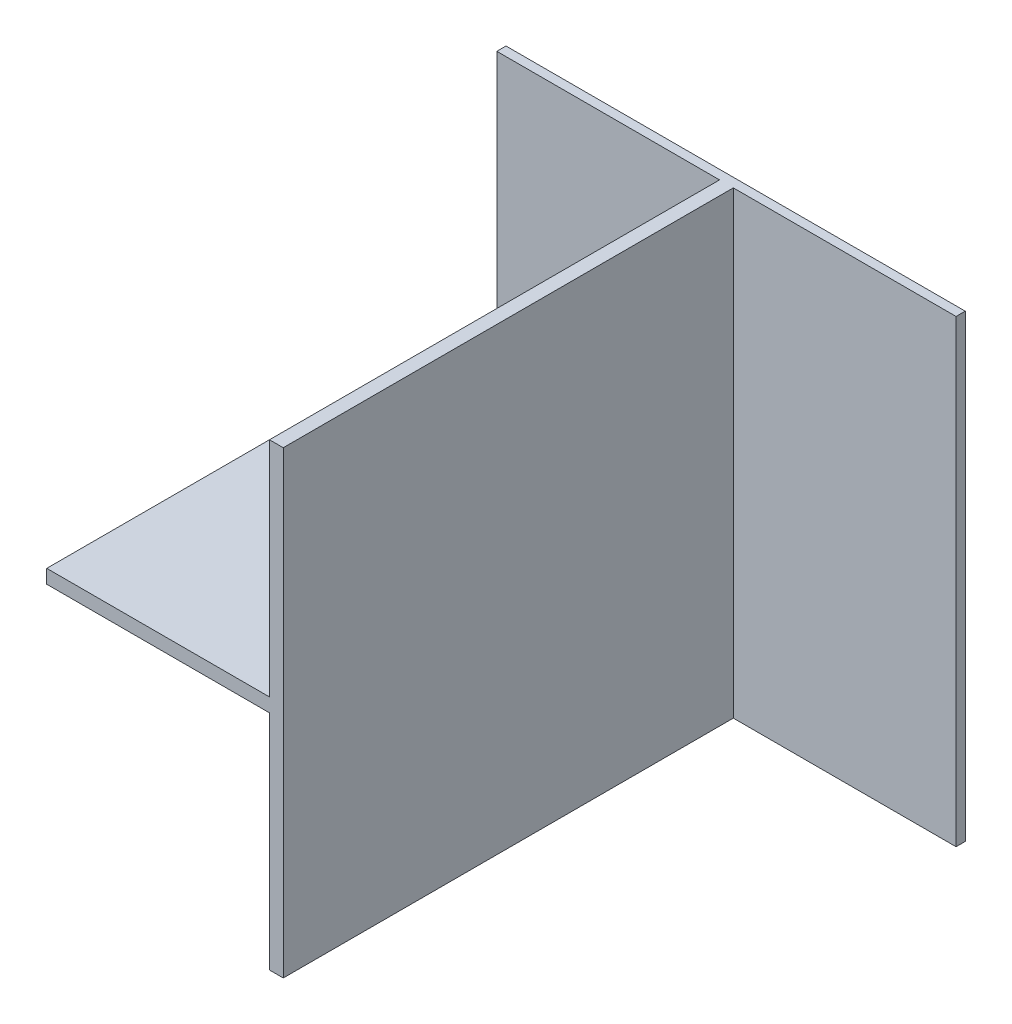
ISO-10303-21;
HEADER;
FILE_DESCRIPTION(('STEP AP214'),'2;1');
FILE_NAME('part.step','',(''),(''),'','','');
FILE_SCHEMA(('AUTOMOTIVE_DESIGN { 1 0 10303 214 1 1 1 1 }'));
ENDSEC;
DATA;
#1=APPLICATION_CONTEXT('core data for automotive mechanical design processes');
#2=APPLICATION_PROTOCOL_DEFINITION('international standard','automotive_design',2000,#1);
#3=PRODUCT_CONTEXT('',#1,'mechanical');
#4=PRODUCT('Part','Part','',(#3));
#5=PRODUCT_RELATED_PRODUCT_CATEGORY('part','',(#4));
#6=PRODUCT_DEFINITION_FORMATION('','',#4);
#7=PRODUCT_DEFINITION_CONTEXT('part definition',#1,'design');
#8=PRODUCT_DEFINITION('design','',#6,#7);
#9=PRODUCT_DEFINITION_SHAPE('','',#8);
#10=(LENGTH_UNIT() NAMED_UNIT(*) SI_UNIT(.MILLI.,.METRE.));
#11=(NAMED_UNIT(*) PLANE_ANGLE_UNIT() SI_UNIT($,.RADIAN.));
#12=(NAMED_UNIT(*) SI_UNIT($,.STERADIAN.) SOLID_ANGLE_UNIT());
#13=UNCERTAINTY_MEASURE_WITH_UNIT(LENGTH_MEASURE(1.E-05),#10,'distance_accuracy_value','');
#14=(GEOMETRIC_REPRESENTATION_CONTEXT(3) GLOBAL_UNCERTAINTY_ASSIGNED_CONTEXT((#13)) GLOBAL_UNIT_ASSIGNED_CONTEXT((#10,
#11,#12)) REPRESENTATION_CONTEXT('',''));
#15=CARTESIAN_POINT('',(0.,0.,0.));
#16=DIRECTION('',(0.,0.,1.));
#17=DIRECTION('',(1.,0.,0.));
#18=AXIS2_PLACEMENT_3D('',#15,#16,#17);
#19=CARTESIAN_POINT('',(0.,0.,4.));
#20=DIRECTION('',(0.,0.,1.));
#21=DIRECTION('',(1.,0.,0.));
#22=AXIS2_PLACEMENT_3D('',#19,#20,#21);
#23=PLANE('',#22);
#24=DIRECTION('',(-1.,0.,0.));
#25=VECTOR('',#24,1.);
#26=CARTESIAN_POINT('',(0.,2.99999999999999,4.));
#27=LINE('',#26,#25);
#28=CARTESIAN_POINT('',(-3.,2.99999999999999,4.));
#29=VERTEX_POINT('',#28);
#30=CARTESIAN_POINT('',(-100.,2.99999999999999,4.));
#31=VERTEX_POINT('',#30);
#32=EDGE_CURVE('E166',#29,#31,#27,.T.);
#33=ORIENTED_EDGE('',*,*,#32,.F.);
#34=DIRECTION('',(0.,1.,0.));
#35=VECTOR('',#34,1.);
#36=CARTESIAN_POINT('',(-3.,0.,4.));
#37=LINE('',#36,#35);
#38=CARTESIAN_POINT('',(-3.,100.,4.));
#39=VERTEX_POINT('',#38);
#40=EDGE_CURVE('E174',#29,#39,#37,.T.);
#41=ORIENTED_EDGE('',*,*,#40,.T.);
#42=DIRECTION('',(-1.,0.,0.));
#43=VECTOR('',#42,1.);
#44=CARTESIAN_POINT('',(0.,100.,4.));
#45=LINE('',#44,#43);
#46=CARTESIAN_POINT('',(-100.,100.,4.));
#47=VERTEX_POINT('',#46);
#48=EDGE_CURVE('E191',#39,#47,#45,.T.);
#49=ORIENTED_EDGE('',*,*,#48,.T.);
#50=DIRECTION('',(0.,-1.,0.));
#51=VECTOR('',#50,1.);
#52=CARTESIAN_POINT('',(-100.,0.,4.));
#53=LINE('',#52,#51);
#54=EDGE_CURVE('E196',#47,#31,#53,.T.);
#55=ORIENTED_EDGE('',*,*,#54,.T.);
#56=EDGE_LOOP('',(#33,#41,#49,#55));
#57=FACE_BOUND('',#56,.T.);
#58=ADVANCED_FACE('F39',(#57),#23,.T.);
#59=DIRECTION('',(-1.,0.,0.));
#60=VECTOR('',#59,1.);
#61=CARTESIAN_POINT('',(0.,-100.,4.));
#62=LINE('',#61,#60);
#63=CARTESIAN_POINT('',(-3.,-100.,4.));
#64=VERTEX_POINT('',#63);
#65=CARTESIAN_POINT('',(-100.,-100.,4.));
#66=VERTEX_POINT('',#65);
#67=EDGE_CURVE('E187',#64,#66,#62,.T.);
#68=ORIENTED_EDGE('',*,*,#67,.F.);
#69=DIRECTION('',(0.,1.,0.));
#70=VECTOR('',#69,1.);
#71=CARTESIAN_POINT('',(-3.,0.,4.));
#72=LINE('',#71,#70);
#73=CARTESIAN_POINT('',(-3.,-3.00000000000001,4.));
#74=VERTEX_POINT('',#73);
#75=EDGE_CURVE('E160',#64,#74,#72,.T.);
#76=ORIENTED_EDGE('',*,*,#75,.T.);
#77=DIRECTION('',(-1.,0.,0.));
#78=VECTOR('',#77,1.);
#79=CARTESIAN_POINT('',(0.,-3.00000000000002,4.));
#80=LINE('',#79,#78);
#81=CARTESIAN_POINT('',(-100.,-3.00000000000001,4.));
#82=VERTEX_POINT('',#81);
#83=EDGE_CURVE('E162',#74,#82,#80,.T.);
#84=ORIENTED_EDGE('',*,*,#83,.T.);
#85=EDGE_CURVE('E63',#82,#66,#53,.T.);
#86=ORIENTED_EDGE('',*,*,#85,.T.);
#87=EDGE_LOOP('',(#68,#76,#84,#86));
#88=FACE_BOUND('',#87,.T.);
#89=ADVANCED_FACE('F289',(#88),#23,.T.);
#90=CARTESIAN_POINT('',(0.,-100.,4.));
#91=DIRECTION('',(0.,-1.,0.));
#92=DIRECTION('',(0.,0.,-1.));
#93=AXIS2_PLACEMENT_3D('',#90,#91,#92);
#94=PLANE('',#93);
#95=CARTESIAN_POINT('',(100.,-100.,4.));
#96=VERTEX_POINT('',#95);
#97=CARTESIAN_POINT('',(3.,-100.,4.));
#98=VERTEX_POINT('',#97);
#99=EDGE_CURVE('E183',#96,#98,#62,.T.);
#100=ORIENTED_EDGE('',*,*,#99,.T.);
#101=DIRECTION('',(0.,0.,-1.));
#102=VECTOR('',#101,1.);
#103=CARTESIAN_POINT('',(3.,-100.,200.));
#104=LINE('',#103,#102);
#105=CARTESIAN_POINT('',(3.,-100.,200.));
#106=VERTEX_POINT('',#105);
#107=EDGE_CURVE('E141',#106,#98,#104,.T.);
#108=ORIENTED_EDGE('',*,*,#107,.F.);
#109=DIRECTION('',(1.,0.,0.));
#110=VECTOR('',#109,1.);
#111=CARTESIAN_POINT('',(0.,-100.,200.));
#112=LINE('',#111,#110);
#113=CARTESIAN_POINT('',(-3.,-100.,200.));
#114=VERTEX_POINT('',#113);
#115=EDGE_CURVE('E137',#114,#106,#112,.T.);
#116=ORIENTED_EDGE('',*,*,#115,.F.);
#117=DIRECTION('',(0.,0.,-1.));
#118=VECTOR('',#117,1.);
#119=CARTESIAN_POINT('',(-3.,-100.,200.));
#120=LINE('',#119,#118);
#121=EDGE_CURVE('E140',#114,#64,#120,.T.);
#122=ORIENTED_EDGE('',*,*,#121,.T.);
#123=ORIENTED_EDGE('',*,*,#67,.T.);
#124=DIRECTION('',(0.,0.,-1.));
#125=VECTOR('',#124,1.);
#126=CARTESIAN_POINT('',(-100.,-100.,4.));
#127=LINE('',#126,#125);
#128=CARTESIAN_POINT('',(-100.,-100.,0.));
#129=VERTEX_POINT('',#128);
#130=EDGE_CURVE('E200',#66,#129,#127,.T.);
#131=ORIENTED_EDGE('',*,*,#130,.T.);
#132=DIRECTION('',(-1.,0.,0.));
#133=VECTOR('',#132,1.);
#134=CARTESIAN_POINT('',(0.,-100.,0.));
#135=LINE('',#134,#133);
#136=CARTESIAN_POINT('',(100.,-100.,0.));
#137=VERTEX_POINT('',#136);
#138=EDGE_CURVE('E85',#137,#129,#135,.T.);
#139=ORIENTED_EDGE('',*,*,#138,.F.);
#140=DIRECTION('',(0.,0.,-1.));
#141=VECTOR('',#140,1.);
#142=CARTESIAN_POINT('',(100.,-100.,4.));
#143=LINE('',#142,#141);
#144=EDGE_CURVE('E11',#96,#137,#143,.T.);
#145=ORIENTED_EDGE('',*,*,#144,.F.);
#146=EDGE_LOOP('',(#100,#108,#116,#122,#123,#131,#139,#145));
#147=FACE_BOUND('',#146,.T.);
#148=ADVANCED_FACE('F41',(#147),#94,.T.);
#149=CARTESIAN_POINT('',(100.,0.,4.));
#150=DIRECTION('',(1.,0.,0.));
#151=DIRECTION('',(0.,0.,-1.));
#152=AXIS2_PLACEMENT_3D('',#149,#150,#151);
#153=PLANE('',#152);
#154=DIRECTION('',(0.,-1.,0.));
#155=VECTOR('',#154,1.);
#156=CARTESIAN_POINT('',(100.,0.,0.));
#157=LINE('',#156,#155);
#158=CARTESIAN_POINT('',(100.,100.,0.));
#159=VERTEX_POINT('',#158);
#160=EDGE_CURVE('E203',#159,#137,#157,.T.);
#161=ORIENTED_EDGE('',*,*,#160,.F.);
#162=DIRECTION('',(0.,0.,-1.));
#163=VECTOR('',#162,1.);
#164=CARTESIAN_POINT('',(100.,100.,4.));
#165=LINE('',#164,#163);
#166=CARTESIAN_POINT('',(100.,100.,4.));
#167=VERTEX_POINT('',#166);
#168=EDGE_CURVE('E48',#167,#159,#165,.T.);
#169=ORIENTED_EDGE('',*,*,#168,.F.);
#170=DIRECTION('',(0.,-1.,0.));
#171=VECTOR('',#170,1.);
#172=CARTESIAN_POINT('',(100.,0.,4.));
#173=LINE('',#172,#171);
#174=EDGE_CURVE('E186',#167,#96,#173,.T.);
#175=ORIENTED_EDGE('',*,*,#174,.T.);
#176=ORIENTED_EDGE('',*,*,#144,.T.);
#177=EDGE_LOOP('',(#161,#169,#175,#176));
#178=FACE_BOUND('',#177,.T.);
#179=ADVANCED_FACE('F229',(#178),#153,.T.);
#180=CARTESIAN_POINT('',(0.,100.,4.));
#181=DIRECTION('',(0.,-1.,0.));
#182=DIRECTION('',(0.,0.,-1.));
#183=AXIS2_PLACEMENT_3D('',#180,#181,#182);
#184=PLANE('',#183);
#185=DIRECTION('',(-1.,0.,0.));
#186=VECTOR('',#185,1.);
#187=CARTESIAN_POINT('',(0.,100.,0.));
#188=LINE('',#187,#186);
#189=CARTESIAN_POINT('',(-100.,100.,0.));
#190=VERTEX_POINT('',#189);
#191=EDGE_CURVE('E206',#159,#190,#188,.T.);
#192=ORIENTED_EDGE('',*,*,#191,.T.);
#193=DIRECTION('',(0.,0.,-1.));
#194=VECTOR('',#193,1.);
#195=CARTESIAN_POINT('',(-100.,100.,4.));
#196=LINE('',#195,#194);
#197=EDGE_CURVE('E215',#47,#190,#196,.T.);
#198=ORIENTED_EDGE('',*,*,#197,.F.);
#199=ORIENTED_EDGE('',*,*,#48,.F.);
#200=DIRECTION('',(0.,0.,-1.));
#201=VECTOR('',#200,1.);
#202=CARTESIAN_POINT('',(-3.,100.,200.));
#203=LINE('',#202,#201);
#204=CARTESIAN_POINT('',(-3.,100.,200.));
#205=VERTEX_POINT('',#204);
#206=EDGE_CURVE('E238',#205,#39,#203,.T.);
#207=ORIENTED_EDGE('',*,*,#206,.F.);
#208=DIRECTION('',(-1.,0.,0.));
#209=VECTOR('',#208,1.);
#210=CARTESIAN_POINT('',(0.,100.,200.));
#211=LINE('',#210,#209);
#212=CARTESIAN_POINT('',(3.,100.,200.));
#213=VERTEX_POINT('',#212);
#214=EDGE_CURVE('E264',#213,#205,#211,.T.);
#215=ORIENTED_EDGE('',*,*,#214,.F.);
#216=DIRECTION('',(0.,0.,-1.));
#217=VECTOR('',#216,1.);
#218=CARTESIAN_POINT('',(3.,100.,200.));
#219=LINE('',#218,#217);
#220=CARTESIAN_POINT('',(3.,100.,4.));
#221=VERTEX_POINT('',#220);
#222=EDGE_CURVE('E168',#213,#221,#219,.T.);
#223=ORIENTED_EDGE('',*,*,#222,.T.);
#224=EDGE_CURVE('E192',#167,#221,#45,.T.);
#225=ORIENTED_EDGE('',*,*,#224,.F.);
#226=ORIENTED_EDGE('',*,*,#168,.T.);
#227=EDGE_LOOP('',(#192,#198,#199,#207,#215,#223,#225,#226));
#228=FACE_BOUND('',#227,.T.);
#229=ADVANCED_FACE('F222',(#228),#184,.F.);
#230=CARTESIAN_POINT('',(-100.,0.,4.));
#231=DIRECTION('',(1.,0.,0.));
#232=DIRECTION('',(0.,0.,-1.));
#233=AXIS2_PLACEMENT_3D('',#230,#231,#232);
#234=PLANE('',#233);
#235=DIRECTION('',(0.,-1.,0.));
#236=VECTOR('',#235,1.);
#237=CARTESIAN_POINT('',(-100.,0.,0.));
#238=LINE('',#237,#236);
#239=EDGE_CURVE('E209',#190,#129,#238,.T.);
#240=ORIENTED_EDGE('',*,*,#239,.T.);
#241=ORIENTED_EDGE('',*,*,#130,.F.);
#242=ORIENTED_EDGE('',*,*,#85,.F.);
#243=DIRECTION('',(0.,0.,-1.));
#244=VECTOR('',#243,1.);
#245=CARTESIAN_POINT('',(-100.,-3.00000000000001,200.));
#246=LINE('',#245,#244);
#247=CARTESIAN_POINT('',(-100.,-3.00000000000001,200.));
#248=VERTEX_POINT('',#247);
#249=EDGE_CURVE('E55',#248,#82,#246,.T.);
#250=ORIENTED_EDGE('',*,*,#249,.F.);
#251=DIRECTION('',(0.,1.,0.));
#252=VECTOR('',#251,1.);
#253=CARTESIAN_POINT('',(-100.,0.,200.));
#254=LINE('',#253,#252);
#255=CARTESIAN_POINT('',(-100.,2.99999999999999,200.));
#256=VERTEX_POINT('',#255);
#257=EDGE_CURVE('E280',#248,#256,#254,.T.);
#258=ORIENTED_EDGE('',*,*,#257,.T.);
#259=DIRECTION('',(0.,0.,-1.));
#260=VECTOR('',#259,1.);
#261=CARTESIAN_POINT('',(-100.,2.99999999999999,200.));
#262=LINE('',#261,#260);
#263=EDGE_CURVE('E256',#256,#31,#262,.T.);
#264=ORIENTED_EDGE('',*,*,#263,.T.);
#265=ORIENTED_EDGE('',*,*,#54,.F.);
#266=ORIENTED_EDGE('',*,*,#197,.T.);
#267=EDGE_LOOP('',(#240,#241,#242,#250,#258,#264,#265,#266));
#268=FACE_BOUND('',#267,.T.);
#269=ADVANCED_FACE('F232',(#268),#234,.F.);
#270=DIRECTION('',(0.,1.,0.));
#271=VECTOR('',#270,1.);
#272=CARTESIAN_POINT('',(3.,0.,4.));
#273=LINE('',#272,#271);
#274=EDGE_CURVE('E178',#98,#221,#273,.T.);
#275=ORIENTED_EDGE('',*,*,#274,.F.);
#276=ORIENTED_EDGE('',*,*,#99,.F.);
#277=ORIENTED_EDGE('',*,*,#174,.F.);
#278=ORIENTED_EDGE('',*,*,#224,.T.);
#279=EDGE_LOOP('',(#275,#276,#277,#278));
#280=FACE_BOUND('',#279,.T.);
#281=ADVANCED_FACE('F268',(#280),#23,.T.);
#282=CARTESIAN_POINT('',(0.,0.,0.));
#283=DIRECTION('',(0.,0.,1.));
#284=DIRECTION('',(1.,0.,0.));
#285=AXIS2_PLACEMENT_3D('',#282,#283,#284);
#286=PLANE('',#285);
#287=ORIENTED_EDGE('',*,*,#138,.T.);
#288=ORIENTED_EDGE('',*,*,#239,.F.);
#289=ORIENTED_EDGE('',*,*,#191,.F.);
#290=ORIENTED_EDGE('',*,*,#160,.T.);
#291=EDGE_LOOP('',(#287,#288,#289,#290));
#292=FACE_BOUND('',#291,.T.);
#293=ADVANCED_FACE('F228',(#292),#286,.F.);
#294=CARTESIAN_POINT('',(-3.,0.,200.));
#295=DIRECTION('',(1.,0.,0.));
#296=DIRECTION('',(0.,1.,0.));
#297=AXIS2_PLACEMENT_3D('',#294,#295,#296);
#298=PLANE('',#297);
#299=ORIENTED_EDGE('',*,*,#75,.F.);
#300=ORIENTED_EDGE('',*,*,#121,.F.);
#301=DIRECTION('',(0.,-1.,0.));
#302=VECTOR('',#301,1.);
#303=CARTESIAN_POINT('',(-3.,0.,200.));
#304=LINE('',#303,#302);
#305=CARTESIAN_POINT('',(-3.,-3.00000000000001,200.));
#306=VERTEX_POINT('',#305);
#307=EDGE_CURVE('E147',#306,#114,#304,.T.);
#308=ORIENTED_EDGE('',*,*,#307,.F.);
#309=DIRECTION('',(0.,0.,-1.));
#310=VECTOR('',#309,1.);
#311=CARTESIAN_POINT('',(-3.,-3.00000000000001,200.));
#312=LINE('',#311,#310);
#313=EDGE_CURVE('E286',#306,#74,#312,.T.);
#314=ORIENTED_EDGE('',*,*,#313,.T.);
#315=EDGE_LOOP('',(#299,#300,#308,#314));
#316=FACE_BOUND('',#315,.T.);
#317=ADVANCED_FACE('F158',(#316),#298,.F.);
#318=CARTESIAN_POINT('',(3.,0.,200.));
#319=DIRECTION('',(1.,0.,0.));
#320=DIRECTION('',(0.,1.,0.));
#321=AXIS2_PLACEMENT_3D('',#318,#319,#320);
#322=PLANE('',#321);
#323=ORIENTED_EDGE('',*,*,#107,.T.);
#324=ORIENTED_EDGE('',*,*,#274,.T.);
#325=ORIENTED_EDGE('',*,*,#222,.F.);
#326=DIRECTION('',(0.,-1.,0.));
#327=VECTOR('',#326,1.);
#328=CARTESIAN_POINT('',(3.,0.,200.));
#329=LINE('',#328,#327);
#330=EDGE_CURVE('E146',#213,#106,#329,.T.);
#331=ORIENTED_EDGE('',*,*,#330,.T.);
#332=EDGE_LOOP('',(#323,#324,#325,#331));
#333=FACE_BOUND('',#332,.T.);
#334=ADVANCED_FACE('F269',(#333),#322,.T.);
#335=CARTESIAN_POINT('',(-3.,0.,200.));
#336=DIRECTION('',(1.,0.,0.));
#337=DIRECTION('',(0.,1.,0.));
#338=AXIS2_PLACEMENT_3D('',#335,#336,#337);
#339=PLANE('',#338);
#340=ORIENTED_EDGE('',*,*,#40,.F.);
#341=DIRECTION('',(0.,0.,-1.));
#342=VECTOR('',#341,1.);
#343=CARTESIAN_POINT('',(-3.,2.99999999999999,200.));
#344=LINE('',#343,#342);
#345=CARTESIAN_POINT('',(-3.,2.99999999999999,200.));
#346=VERTEX_POINT('',#345);
#347=EDGE_CURVE('E249',#346,#29,#344,.T.);
#348=ORIENTED_EDGE('',*,*,#347,.F.);
#349=DIRECTION('',(0.,-1.,0.));
#350=VECTOR('',#349,1.);
#351=CARTESIAN_POINT('',(-3.,0.,200.));
#352=LINE('',#351,#350);
#353=EDGE_CURVE('E273',#205,#346,#352,.T.);
#354=ORIENTED_EDGE('',*,*,#353,.F.);
#355=ORIENTED_EDGE('',*,*,#206,.T.);
#356=EDGE_LOOP('',(#340,#348,#354,#355));
#357=FACE_BOUND('',#356,.T.);
#358=ADVANCED_FACE('F248',(#357),#339,.F.);
#359=CARTESIAN_POINT('',(0.,2.99999999999999,200.));
#360=DIRECTION('',(0.,1.,0.));
#361=DIRECTION('',(-1.,0.,0.));
#362=AXIS2_PLACEMENT_3D('',#359,#360,#361);
#363=PLANE('',#362);
#364=ORIENTED_EDGE('',*,*,#347,.T.);
#365=ORIENTED_EDGE('',*,*,#32,.T.);
#366=ORIENTED_EDGE('',*,*,#263,.F.);
#367=DIRECTION('',(1.,0.,0.));
#368=VECTOR('',#367,1.);
#369=CARTESIAN_POINT('',(0.,2.99999999999999,200.));
#370=LINE('',#369,#368);
#371=EDGE_CURVE('E254',#256,#346,#370,.T.);
#372=ORIENTED_EDGE('',*,*,#371,.T.);
#373=EDGE_LOOP('',(#364,#365,#366,#372));
#374=FACE_BOUND('',#373,.T.);
#375=ADVANCED_FACE('F252',(#374),#363,.T.);
#376=CARTESIAN_POINT('',(0.,-3.00000000000002,200.));
#377=DIRECTION('',(0.,1.,0.));
#378=DIRECTION('',(-1.,0.,0.));
#379=AXIS2_PLACEMENT_3D('',#376,#377,#378);
#380=PLANE('',#379);
#381=ORIENTED_EDGE('',*,*,#83,.F.);
#382=ORIENTED_EDGE('',*,*,#313,.F.);
#383=DIRECTION('',(1.,0.,0.));
#384=VECTOR('',#383,1.);
#385=CARTESIAN_POINT('',(0.,-3.00000000000002,200.));
#386=LINE('',#385,#384);
#387=EDGE_CURVE('E152',#248,#306,#386,.T.);
#388=ORIENTED_EDGE('',*,*,#387,.F.);
#389=ORIENTED_EDGE('',*,*,#249,.T.);
#390=EDGE_LOOP('',(#381,#382,#388,#389));
#391=FACE_BOUND('',#390,.T.);
#392=ADVANCED_FACE('F290',(#391),#380,.F.);
#393=CARTESIAN_POINT('',(0.,0.,200.));
#394=DIRECTION('',(0.,0.,1.));
#395=DIRECTION('',(1.,0.,0.));
#396=AXIS2_PLACEMENT_3D('',#393,#394,#395);
#397=PLANE('',#396);
#398=ORIENTED_EDGE('',*,*,#307,.T.);
#399=ORIENTED_EDGE('',*,*,#115,.T.);
#400=ORIENTED_EDGE('',*,*,#330,.F.);
#401=ORIENTED_EDGE('',*,*,#214,.T.);
#402=ORIENTED_EDGE('',*,*,#353,.T.);
#403=ORIENTED_EDGE('',*,*,#371,.F.);
#404=ORIENTED_EDGE('',*,*,#257,.F.);
#405=ORIENTED_EDGE('',*,*,#387,.T.);
#406=EDGE_LOOP('',(#398,#399,#400,#401,#402,#403,#404,#405));
#407=FACE_BOUND('',#406,.T.);
#408=ADVANCED_FACE('F150',(#407),#397,.T.);
#409=CLOSED_SHELL('',(#58,#89,#148,#179,#229,#269,#281,#293,#317,#334,#358,#375,#392,#408));
#410=MANIFOLD_SOLID_BREP('B2',#409);
#411=ADVANCED_BREP_SHAPE_REPRESENTATION('',(#18,#410),#14);
#412=SHAPE_DEFINITION_REPRESENTATION(#9,#411);
ENDSEC;
END-ISO-10303-21;
